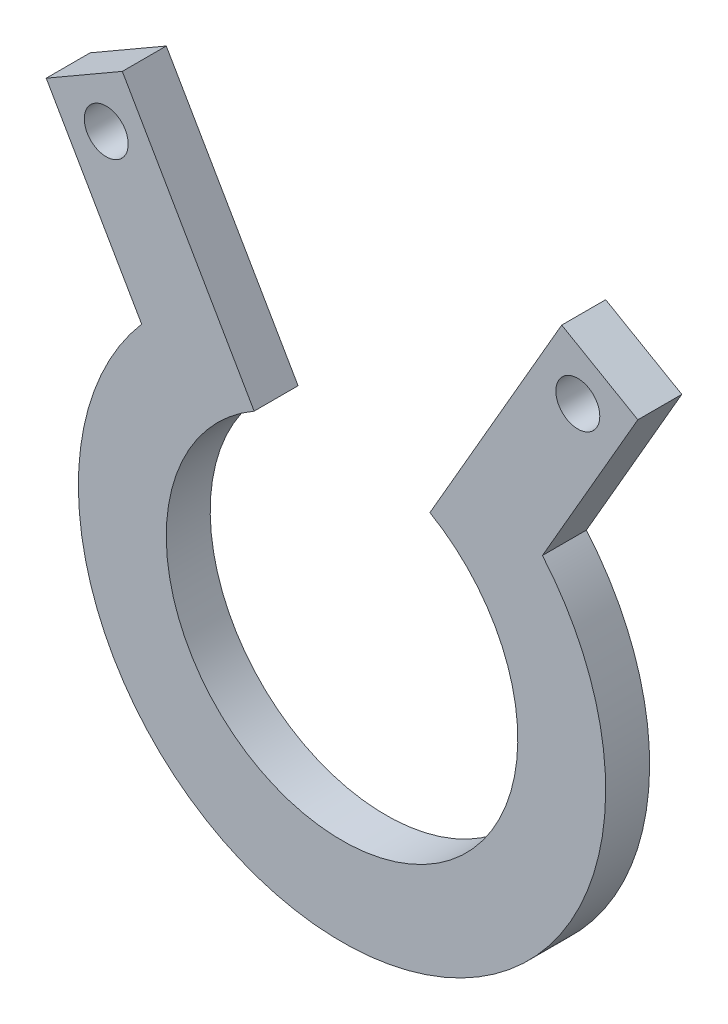
ISO-10303-21;
HEADER;
FILE_DESCRIPTION(('STEP AP214'),'2;1');
FILE_NAME('part.step','',(''),(''),'','','');
FILE_SCHEMA(('AUTOMOTIVE_DESIGN { 1 0 10303 214 1 1 1 1 }'));
ENDSEC;
DATA;
#1=APPLICATION_CONTEXT('core data for automotive mechanical design processes');
#2=APPLICATION_PROTOCOL_DEFINITION('international standard','automotive_design',2000,#1);
#3=PRODUCT_CONTEXT('',#1,'mechanical');
#4=PRODUCT('Part','Part','',(#3));
#5=PRODUCT_RELATED_PRODUCT_CATEGORY('part','',(#4));
#6=PRODUCT_DEFINITION_FORMATION('','',#4);
#7=PRODUCT_DEFINITION_CONTEXT('part definition',#1,'design');
#8=PRODUCT_DEFINITION('design','',#6,#7);
#9=PRODUCT_DEFINITION_SHAPE('','',#8);
#10=(LENGTH_UNIT() NAMED_UNIT(*) SI_UNIT(.MILLI.,.METRE.));
#11=(NAMED_UNIT(*) PLANE_ANGLE_UNIT() SI_UNIT($,.RADIAN.));
#12=(NAMED_UNIT(*) SI_UNIT($,.STERADIAN.) SOLID_ANGLE_UNIT());
#13=UNCERTAINTY_MEASURE_WITH_UNIT(LENGTH_MEASURE(1.E-05),#10,'distance_accuracy_value','');
#14=(GEOMETRIC_REPRESENTATION_CONTEXT(3) GLOBAL_UNCERTAINTY_ASSIGNED_CONTEXT((#13)) GLOBAL_UNIT_ASSIGNED_CONTEXT((#10,
#11,#12)) REPRESENTATION_CONTEXT('',''));
#15=CARTESIAN_POINT('',(0.,0.,0.));
#16=DIRECTION('',(0.,0.,1.));
#17=DIRECTION('',(1.,0.,0.));
#18=AXIS2_PLACEMENT_3D('',#15,#16,#17);
#19=CARTESIAN_POINT('',(0.,0.,3.175));
#20=DIRECTION('',(0.,0.,-1.));
#21=DIRECTION('',(-1.,0.,0.));
#22=AXIS2_PLACEMENT_3D('',#19,#20,#21);
#23=CYLINDRICAL_SURFACE('',#22,19.05);
#24=DIRECTION('',(0.,0.,1.));
#25=VECTOR('',#24,1.);
#26=CARTESIAN_POINT('',(14.4795174351003,12.3792598666732,-19.2075530644451));
#27=LINE('',#26,#25);
#28=CARTESIAN_POINT('',(14.4795174351003,12.3792598666732,0.));
#29=VERTEX_POINT('',#28);
#30=CARTESIAN_POINT('',(14.4795174351003,12.3792598666732,3.175));
#31=VERTEX_POINT('',#30);
#32=EDGE_CURVE('E64',#29,#31,#27,.T.);
#33=ORIENTED_EDGE('',*,*,#32,.T.);
#34=CARTESIAN_POINT('',(0.,0.,3.175));
#35=DIRECTION('',(0.,0.,1.));
#36=DIRECTION('',(1.,0.,0.));
#37=AXIS2_PLACEMENT_3D('',#34,#35,#36);
#38=CIRCLE('',#37,19.05);
#39=CARTESIAN_POINT('',(-14.4795174351003,12.3792598666732,3.175));
#40=VERTEX_POINT('',#39);
#41=EDGE_CURVE('E56',#40,#31,#38,.T.);
#42=ORIENTED_EDGE('',*,*,#41,.F.);
#43=DIRECTION('',(0.,0.,1.));
#44=VECTOR('',#43,1.);
#45=CARTESIAN_POINT('',(-14.4795174351003,12.3792598666732,-19.2075530644451));
#46=LINE('',#45,#44);
#47=CARTESIAN_POINT('',(-14.4795174351003,12.3792598666732,0.));
#48=VERTEX_POINT('',#47);
#49=EDGE_CURVE('E144',#48,#40,#46,.T.);
#50=ORIENTED_EDGE('',*,*,#49,.F.);
#51=CARTESIAN_POINT('',(0.,0.,0.));
#52=DIRECTION('',(0.,0.,1.));
#53=DIRECTION('',(1.,0.,0.));
#54=AXIS2_PLACEMENT_3D('',#51,#52,#53);
#55=CIRCLE('',#54,19.05);
#56=EDGE_CURVE('E69',#48,#29,#55,.T.);
#57=ORIENTED_EDGE('',*,*,#56,.T.);
#58=EDGE_LOOP('',(#33,#42,#50,#57));
#59=FACE_BOUND('',#58,.T.);
#60=ADVANCED_FACE('F48',(#59),#23,.T.);
#61=CARTESIAN_POINT('',(0.,0.,3.175));
#62=DIRECTION('',(0.,0.,-1.));
#63=DIRECTION('',(-1.,0.,0.));
#64=AXIS2_PLACEMENT_3D('',#61,#62,#63);
#65=CYLINDRICAL_SURFACE('',#64,12.7);
#66=DIRECTION('',(0.,0.,-1.));
#67=VECTOR('',#66,1.);
#68=CARTESIAN_POINT('',(6.35000000000001,10.9985226280624,3.175));
#69=LINE('',#68,#67);
#70=CARTESIAN_POINT('',(6.35000000000002,10.9985226280624,0.));
#71=VERTEX_POINT('',#70);
#72=CARTESIAN_POINT('',(6.35000000000001,10.9985226280624,3.175));
#73=VERTEX_POINT('',#72);
#74=EDGE_CURVE('E131',#71,#73,#69,.F.);
#75=ORIENTED_EDGE('',*,*,#74,.F.);
#76=CARTESIAN_POINT('',(0.,0.,0.));
#77=DIRECTION('',(0.,0.,1.));
#78=DIRECTION('',(1.,0.,0.));
#79=AXIS2_PLACEMENT_3D('',#76,#77,#78);
#80=CIRCLE('',#79,12.7);
#81=CARTESIAN_POINT('',(-6.35000000000001,10.9985226280624,0.));
#82=VERTEX_POINT('',#81);
#83=EDGE_CURVE('E51',#82,#71,#80,.T.);
#84=ORIENTED_EDGE('',*,*,#83,.F.);
#85=DIRECTION('',(0.,0.,-1.));
#86=VECTOR('',#85,1.);
#87=CARTESIAN_POINT('',(-6.35000000000001,10.9985226280624,3.175));
#88=LINE('',#87,#86);
#89=CARTESIAN_POINT('',(-6.35000000000001,10.9985226280624,3.175));
#90=VERTEX_POINT('',#89);
#91=EDGE_CURVE('E125',#90,#82,#88,.T.);
#92=ORIENTED_EDGE('',*,*,#91,.F.);
#93=CARTESIAN_POINT('',(0.,0.,3.175));
#94=DIRECTION('',(0.,0.,1.));
#95=DIRECTION('',(1.,0.,0.));
#96=AXIS2_PLACEMENT_3D('',#93,#94,#95);
#97=CIRCLE('',#96,12.7);
#98=EDGE_CURVE('E13',#90,#73,#97,.T.);
#99=ORIENTED_EDGE('',*,*,#98,.T.);
#100=EDGE_LOOP('',(#75,#84,#92,#99));
#101=FACE_BOUND('',#100,.T.);
#102=ADVANCED_FACE('F134',(#101),#65,.F.);
#103=CARTESIAN_POINT('',(0.,0.,3.175));
#104=DIRECTION('',(0.,0.,1.));
#105=DIRECTION('',(1.,0.,0.));
#106=AXIS2_PLACEMENT_3D('',#103,#104,#105);
#107=PLANE('',#106);
#108=DIRECTION('',(-0.500000000000001,-0.866025403784438,0.));
#109=VECTOR('',#108,1.);
#110=CARTESIAN_POINT('',(0.,0.,3.175));
#111=LINE('',#110,#109);
#112=CARTESIAN_POINT('',(15.875,27.4963065701559,3.175));
#113=VERTEX_POINT('',#112);
#114=EDGE_CURVE('E177',#113,#73,#111,.T.);
#115=ORIENTED_EDGE('',*,*,#114,.T.);
#116=ORIENTED_EDGE('',*,*,#98,.F.);
#117=DIRECTION('',(-0.500000000000001,0.866025403784438,0.));
#118=VECTOR('',#117,1.);
#119=CARTESIAN_POINT('',(0.,0.,3.175));
#120=LINE('',#119,#118);
#121=CARTESIAN_POINT('',(-15.875,27.4963065701559,3.175));
#122=VERTEX_POINT('',#121);
#123=EDGE_CURVE('E128',#90,#122,#120,.T.);
#124=ORIENTED_EDGE('',*,*,#123,.T.);
#125=DIRECTION('',(-0.866025403784438,-0.500000000000001,0.));
#126=VECTOR('',#125,1.);
#127=CARTESIAN_POINT('',(-15.875,27.4963065701559,3.175));
#128=LINE('',#127,#126);
#129=CARTESIAN_POINT('',(-21.3742613140312,24.3213065701559,3.175));
#130=VERTEX_POINT('',#129);
#131=EDGE_CURVE('E147',#122,#130,#128,.T.);
#132=ORIENTED_EDGE('',*,*,#131,.T.);
#133=DIRECTION('',(0.500000000000002,-0.866025403784438,0.));
#134=VECTOR('',#133,1.);
#135=CARTESIAN_POINT('',(-5.49926131403116,-3.175,3.175));
#136=LINE('',#135,#134);
#137=EDGE_CURVE('E157',#130,#40,#136,.T.);
#138=ORIENTED_EDGE('',*,*,#137,.T.);
#139=ORIENTED_EDGE('',*,*,#41,.T.);
#140=DIRECTION('',(-0.500000000000002,-0.866025403784438,0.));
#141=VECTOR('',#140,1.);
#142=CARTESIAN_POINT('',(5.49926131403116,-3.175,3.175));
#143=LINE('',#142,#141);
#144=CARTESIAN_POINT('',(21.3742613140312,24.3213065701559,3.175));
#145=VERTEX_POINT('',#144);
#146=EDGE_CURVE('E178',#145,#31,#143,.T.);
#147=ORIENTED_EDGE('',*,*,#146,.F.);
#148=DIRECTION('',(0.866025403784438,-0.500000000000001,0.));
#149=VECTOR('',#148,1.);
#150=CARTESIAN_POINT('',(15.875,27.4963065701559,3.175));
#151=LINE('',#150,#149);
#152=EDGE_CURVE('E170',#113,#145,#151,.T.);
#153=ORIENTED_EDGE('',*,*,#152,.F.);
#154=EDGE_LOOP('',(#115,#116,#124,#132,#138,#139,#147,#153));
#155=FACE_BOUND('',#154,.T.);
#156=CARTESIAN_POINT('',(-17.0371306570156,23.1591759131403,3.175));
#157=DIRECTION('',(0.,0.,1.));
#158=DIRECTION('',(1.,0.,0.));
#159=AXIS2_PLACEMENT_3D('',#156,#157,#158);
#160=CIRCLE('',#159,1.58749999999998);
#161=CARTESIAN_POINT('',(-15.4496306570156,23.1591759131403,3.175));
#162=VERTEX_POINT('',#161);
#163=EDGE_CURVE('E148',#162,#162,#160,.T.);
#164=ORIENTED_EDGE('',*,*,#163,.F.);
#165=EDGE_LOOP('',(#164));
#166=FACE_BOUND('',#165,.T.);
#167=CARTESIAN_POINT('',(17.0371306570156,23.1591759131403,3.175));
#168=DIRECTION('',(0.,0.,1.));
#169=DIRECTION('',(1.,0.,0.));
#170=AXIS2_PLACEMENT_3D('',#167,#168,#169);
#171=CIRCLE('',#170,1.58749999999998);
#172=CARTESIAN_POINT('',(18.6246306570156,23.1591759131403,3.175));
#173=VERTEX_POINT('',#172);
#174=EDGE_CURVE('E164',#173,#173,#171,.F.);
#175=ORIENTED_EDGE('',*,*,#174,.T.);
#176=EDGE_LOOP('',(#175));
#177=FACE_BOUND('',#176,.T.);
#178=ADVANCED_FACE('F192',(#155,#166,#177),#107,.T.);
#179=CARTESIAN_POINT('',(0.,0.,0.));
#180=DIRECTION('',(0.,0.,1.));
#181=DIRECTION('',(1.,0.,0.));
#182=AXIS2_PLACEMENT_3D('',#179,#180,#181);
#183=PLANE('',#182);
#184=ORIENTED_EDGE('',*,*,#83,.T.);
#185=DIRECTION('',(0.500000000000001,0.866025403784438,0.));
#186=VECTOR('',#185,1.);
#187=CARTESIAN_POINT('',(0.,0.,0.));
#188=LINE('',#187,#186);
#189=CARTESIAN_POINT('',(15.875,27.4963065701559,0.));
#190=VERTEX_POINT('',#189);
#191=EDGE_CURVE('E143',#71,#190,#188,.T.);
#192=ORIENTED_EDGE('',*,*,#191,.T.);
#193=DIRECTION('',(-0.866025403784438,0.500000000000001,0.));
#194=VECTOR('',#193,1.);
#195=CARTESIAN_POINT('',(15.875,27.4963065701559,0.));
#196=LINE('',#195,#194);
#197=CARTESIAN_POINT('',(21.3742613140312,24.3213065701559,0.));
#198=VERTEX_POINT('',#197);
#199=EDGE_CURVE('E171',#198,#190,#196,.T.);
#200=ORIENTED_EDGE('',*,*,#199,.F.);
#201=DIRECTION('',(0.500000000000002,0.866025403784438,0.));
#202=VECTOR('',#201,1.);
#203=CARTESIAN_POINT('',(5.49926131403116,-3.175,0.));
#204=LINE('',#203,#202);
#205=EDGE_CURVE('E166',#29,#198,#204,.T.);
#206=ORIENTED_EDGE('',*,*,#205,.F.);
#207=ORIENTED_EDGE('',*,*,#56,.F.);
#208=DIRECTION('',(-0.500000000000002,0.866025403784438,0.));
#209=VECTOR('',#208,1.);
#210=CARTESIAN_POINT('',(-5.49926131403116,-3.175,0.));
#211=LINE('',#210,#209);
#212=CARTESIAN_POINT('',(-21.3742613140312,24.3213065701559,0.));
#213=VERTEX_POINT('',#212);
#214=EDGE_CURVE('E122',#48,#213,#211,.T.);
#215=ORIENTED_EDGE('',*,*,#214,.T.);
#216=DIRECTION('',(0.866025403784438,0.500000000000001,0.));
#217=VECTOR('',#216,1.);
#218=CARTESIAN_POINT('',(-15.875,27.4963065701559,0.));
#219=LINE('',#218,#217);
#220=CARTESIAN_POINT('',(-15.875,27.4963065701559,0.));
#221=VERTEX_POINT('',#220);
#222=EDGE_CURVE('E119',#213,#221,#219,.T.);
#223=ORIENTED_EDGE('',*,*,#222,.T.);
#224=DIRECTION('',(0.500000000000001,-0.866025403784438,0.));
#225=VECTOR('',#224,1.);
#226=CARTESIAN_POINT('',(0.,0.,0.));
#227=LINE('',#226,#225);
#228=EDGE_CURVE('E113',#221,#82,#227,.T.);
#229=ORIENTED_EDGE('',*,*,#228,.T.);
#230=EDGE_LOOP('',(#184,#192,#200,#206,#207,#215,#223,#229));
#231=FACE_BOUND('',#230,.T.);
#232=CARTESIAN_POINT('',(-17.0371306570156,23.1591759131403,0.));
#233=DIRECTION('',(0.,0.,1.));
#234=DIRECTION('',(1.,0.,0.));
#235=AXIS2_PLACEMENT_3D('',#232,#233,#234);
#236=CIRCLE('',#235,1.58749999999998);
#237=CARTESIAN_POINT('',(-15.4496306570156,23.1591759131403,0.));
#238=VERTEX_POINT('',#237);
#239=EDGE_CURVE('E149',#238,#238,#236,.F.);
#240=ORIENTED_EDGE('',*,*,#239,.F.);
#241=EDGE_LOOP('',(#240));
#242=FACE_BOUND('',#241,.T.);
#243=CARTESIAN_POINT('',(17.0371306570156,23.1591759131403,0.));
#244=DIRECTION('',(0.,0.,1.));
#245=DIRECTION('',(1.,0.,0.));
#246=AXIS2_PLACEMENT_3D('',#243,#244,#245);
#247=CIRCLE('',#246,1.58749999999998);
#248=CARTESIAN_POINT('',(18.6246306570156,23.1591759131403,0.));
#249=VERTEX_POINT('',#248);
#250=EDGE_CURVE('E161',#249,#249,#247,.T.);
#251=ORIENTED_EDGE('',*,*,#250,.T.);
#252=EDGE_LOOP('',(#251));
#253=FACE_BOUND('',#252,.T.);
#254=ADVANCED_FACE('F115',(#231,#242,#253),#183,.F.);
#255=CARTESIAN_POINT('',(-15.875,27.4963065701559,-19.2075530644451));
#256=DIRECTION('',(-0.500000000000001,0.866025403784438,0.));
#257=DIRECTION('',(-0.866025403784438,-0.500000000000001,0.));
#258=AXIS2_PLACEMENT_3D('',#255,#256,#257);
#259=PLANE('',#258);
#260=ORIENTED_EDGE('',*,*,#222,.F.);
#261=DIRECTION('',(0.,0.,1.));
#262=VECTOR('',#261,1.);
#263=CARTESIAN_POINT('',(-21.3742613140312,24.3213065701559,-19.2075530644451));
#264=LINE('',#263,#262);
#265=EDGE_CURVE('E140',#213,#130,#264,.T.);
#266=ORIENTED_EDGE('',*,*,#265,.T.);
#267=ORIENTED_EDGE('',*,*,#131,.F.);
#268=DIRECTION('',(0.,0.,1.));
#269=VECTOR('',#268,1.);
#270=CARTESIAN_POINT('',(-15.875,27.4963065701559,-19.2075530644451));
#271=LINE('',#270,#269);
#272=EDGE_CURVE('E142',#221,#122,#271,.T.);
#273=ORIENTED_EDGE('',*,*,#272,.F.);
#274=EDGE_LOOP('',(#260,#266,#267,#273));
#275=FACE_BOUND('',#274,.T.);
#276=ADVANCED_FACE('F221',(#275),#259,.T.);
#277=CARTESIAN_POINT('',(0.,0.,-19.2075530644451));
#278=DIRECTION('',(0.866025403784438,0.500000000000001,0.));
#279=DIRECTION('',(-0.500000000000001,0.866025403784438,0.));
#280=AXIS2_PLACEMENT_3D('',#277,#278,#279);
#281=PLANE('',#280);
#282=ORIENTED_EDGE('',*,*,#228,.F.);
#283=ORIENTED_EDGE('',*,*,#272,.T.);
#284=ORIENTED_EDGE('',*,*,#123,.F.);
#285=ORIENTED_EDGE('',*,*,#91,.T.);
#286=EDGE_LOOP('',(#282,#283,#284,#285));
#287=FACE_BOUND('',#286,.T.);
#288=ADVANCED_FACE('F126',(#287),#281,.T.);
#289=CARTESIAN_POINT('',(-17.0371306570156,23.1591759131403,-19.2075530644451));
#290=DIRECTION('',(0.,0.,1.));
#291=DIRECTION('',(1.,0.,0.));
#292=AXIS2_PLACEMENT_3D('',#289,#290,#291);
#293=CYLINDRICAL_SURFACE('',#292,1.58749999999998);
#294=ORIENTED_EDGE('',*,*,#239,.T.);
#295=EDGE_LOOP('',(#294));
#296=FACE_BOUND('',#295,.T.);
#297=ORIENTED_EDGE('',*,*,#163,.T.);
#298=EDGE_LOOP('',(#297));
#299=FACE_BOUND('',#298,.T.);
#300=ADVANCED_FACE('F228',(#296,#299),#293,.F.);
#301=CARTESIAN_POINT('',(-5.49926131403116,-3.175,-19.2075530644451));
#302=DIRECTION('',(-0.866025403784438,-0.500000000000002,0.));
#303=DIRECTION('',(0.500000000000002,-0.866025403784438,0.));
#304=AXIS2_PLACEMENT_3D('',#301,#302,#303);
#305=PLANE('',#304);
#306=ORIENTED_EDGE('',*,*,#214,.F.);
#307=ORIENTED_EDGE('',*,*,#49,.T.);
#308=ORIENTED_EDGE('',*,*,#137,.F.);
#309=ORIENTED_EDGE('',*,*,#265,.F.);
#310=EDGE_LOOP('',(#306,#307,#308,#309));
#311=FACE_BOUND('',#310,.T.);
#312=ADVANCED_FACE('F209',(#311),#305,.T.);
#313=CARTESIAN_POINT('',(15.875,27.4963065701559,-19.2075530644451));
#314=DIRECTION('',(-0.500000000000001,-0.866025403784438,0.));
#315=DIRECTION('',(0.866025403784438,-0.500000000000001,0.));
#316=AXIS2_PLACEMENT_3D('',#313,#314,#315);
#317=PLANE('',#316);
#318=DIRECTION('',(0.,0.,1.));
#319=VECTOR('',#318,1.);
#320=CARTESIAN_POINT('',(21.3742613140312,24.3213065701559,-19.2075530644451));
#321=LINE('',#320,#319);
#322=EDGE_CURVE('E169',#198,#145,#321,.T.);
#323=ORIENTED_EDGE('',*,*,#322,.F.);
#324=ORIENTED_EDGE('',*,*,#199,.T.);
#325=DIRECTION('',(0.,0.,1.));
#326=VECTOR('',#325,1.);
#327=CARTESIAN_POINT('',(15.875,27.4963065701559,-19.2075530644451));
#328=LINE('',#327,#326);
#329=EDGE_CURVE('E174',#190,#113,#328,.T.);
#330=ORIENTED_EDGE('',*,*,#329,.T.);
#331=ORIENTED_EDGE('',*,*,#152,.T.);
#332=EDGE_LOOP('',(#323,#324,#330,#331));
#333=FACE_BOUND('',#332,.T.);
#334=ADVANCED_FACE('F198',(#333),#317,.F.);
#335=CARTESIAN_POINT('',(5.49926131403116,-3.175,-19.2075530644451));
#336=DIRECTION('',(-0.866025403784438,0.500000000000002,0.));
#337=DIRECTION('',(-0.500000000000002,-0.866025403784438,0.));
#338=AXIS2_PLACEMENT_3D('',#335,#336,#337);
#339=PLANE('',#338);
#340=ORIENTED_EDGE('',*,*,#32,.F.);
#341=ORIENTED_EDGE('',*,*,#205,.T.);
#342=ORIENTED_EDGE('',*,*,#322,.T.);
#343=ORIENTED_EDGE('',*,*,#146,.T.);
#344=EDGE_LOOP('',(#340,#341,#342,#343));
#345=FACE_BOUND('',#344,.T.);
#346=ADVANCED_FACE('F200',(#345),#339,.F.);
#347=CARTESIAN_POINT('',(0.,0.,-19.2075530644451));
#348=DIRECTION('',(-0.866025403784438,0.500000000000001,0.));
#349=DIRECTION('',(-0.500000000000001,-0.866025403784438,0.));
#350=AXIS2_PLACEMENT_3D('',#347,#348,#349);
#351=PLANE('',#350);
#352=ORIENTED_EDGE('',*,*,#191,.F.);
#353=ORIENTED_EDGE('',*,*,#74,.T.);
#354=ORIENTED_EDGE('',*,*,#114,.F.);
#355=ORIENTED_EDGE('',*,*,#329,.F.);
#356=EDGE_LOOP('',(#352,#353,#354,#355));
#357=FACE_BOUND('',#356,.T.);
#358=ADVANCED_FACE('F189',(#357),#351,.T.);
#359=CARTESIAN_POINT('',(17.0371306570156,23.1591759131403,-19.2075530644451));
#360=DIRECTION('',(0.,0.,1.));
#361=DIRECTION('',(1.,0.,0.));
#362=AXIS2_PLACEMENT_3D('',#359,#360,#361);
#363=CYLINDRICAL_SURFACE('',#362,1.58749999999998);
#364=ORIENTED_EDGE('',*,*,#250,.F.);
#365=EDGE_LOOP('',(#364));
#366=FACE_BOUND('',#365,.T.);
#367=ORIENTED_EDGE('',*,*,#174,.F.);
#368=EDGE_LOOP('',(#367));
#369=FACE_BOUND('',#368,.T.);
#370=ADVANCED_FACE('F207',(#366,#369),#363,.F.);
#371=CLOSED_SHELL('',(#60,#102,#178,#254,#276,#288,#300,#312,#334,#346,#358,#370));
#372=MANIFOLD_SOLID_BREP('B2',#371);
#373=ADVANCED_BREP_SHAPE_REPRESENTATION('',(#18,#372),#14);
#374=SHAPE_DEFINITION_REPRESENTATION(#9,#373);
ENDSEC;
END-ISO-10303-21;
